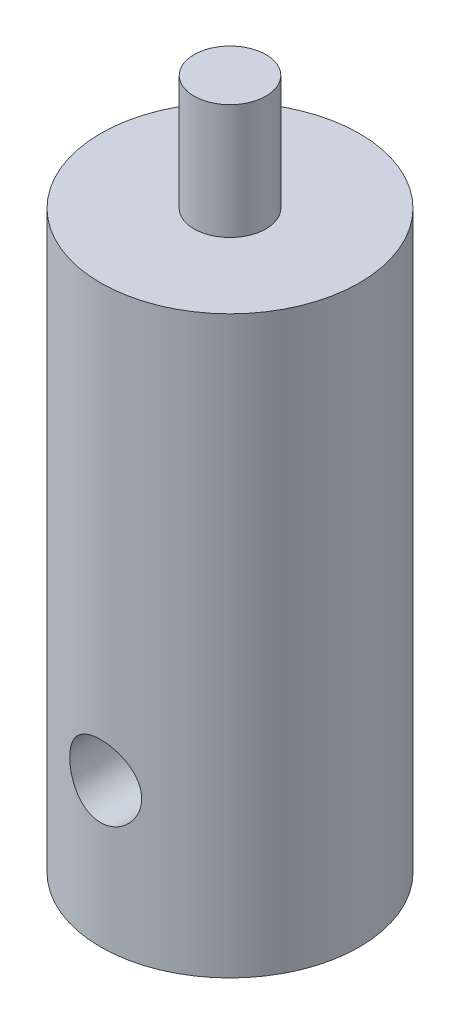
ISO-10303-21;
HEADER;
FILE_DESCRIPTION(('STEP AP214'),'2;1');
FILE_NAME('part.step','',(''),(''),'','','');
FILE_SCHEMA(('AUTOMOTIVE_DESIGN { 1 0 10303 214 1 1 1 1 }'));
ENDSEC;
DATA;
#1=APPLICATION_CONTEXT('core data for automotive mechanical design processes');
#2=APPLICATION_PROTOCOL_DEFINITION('international standard','automotive_design',2000,#1);
#3=PRODUCT_CONTEXT('',#1,'mechanical');
#4=PRODUCT('Part','Part','',(#3));
#5=PRODUCT_RELATED_PRODUCT_CATEGORY('part','',(#4));
#6=PRODUCT_DEFINITION_FORMATION('','',#4);
#7=PRODUCT_DEFINITION_CONTEXT('part definition',#1,'design');
#8=PRODUCT_DEFINITION('design','',#6,#7);
#9=PRODUCT_DEFINITION_SHAPE('','',#8);
#10=(LENGTH_UNIT() NAMED_UNIT(*) SI_UNIT(.MILLI.,.METRE.));
#11=(NAMED_UNIT(*) PLANE_ANGLE_UNIT() SI_UNIT($,.RADIAN.));
#12=(NAMED_UNIT(*) SI_UNIT($,.STERADIAN.) SOLID_ANGLE_UNIT());
#13=UNCERTAINTY_MEASURE_WITH_UNIT(LENGTH_MEASURE(1.E-05),#10,'distance_accuracy_value','');
#14=(GEOMETRIC_REPRESENTATION_CONTEXT(3) GLOBAL_UNCERTAINTY_ASSIGNED_CONTEXT((#13)) GLOBAL_UNIT_ASSIGNED_CONTEXT((#10,
#11,#12)) REPRESENTATION_CONTEXT('',''));
#15=CARTESIAN_POINT('',(0.,0.,0.));
#16=DIRECTION('',(0.,0.,1.));
#17=DIRECTION('',(1.,0.,0.));
#18=AXIS2_PLACEMENT_3D('',#15,#16,#17);
#19=CARTESIAN_POINT('',(0.,25.4,0.));
#20=DIRECTION('',(0.,-1.,0.));
#21=DIRECTION('',(0.,0.,-1.));
#22=AXIS2_PLACEMENT_3D('',#19,#20,#21);
#23=CYLINDRICAL_SURFACE('',#22,5.715);
#24=CARTESIAN_POINT('',(0.,7.9375,-5.715));
#25=CARTESIAN_POINT('',(-0.0873775886216375,7.93749822252676,-5.71499883181499));
#26=CARTESIAN_POINT('',(-0.174773747165887,7.93026186384728,-5.71297656090274));
#27=CARTESIAN_POINT('',(-0.347039534512683,7.90156442510304,-5.70510606751763));
#28=CARTESIAN_POINT('',(-0.431908081652568,7.88009734402357,-5.69925623099563));
#29=CARTESIAN_POINT('',(-0.596607836093983,7.82369692634432,-5.68437478051124));
#30=CARTESIAN_POINT('',(-0.676445675421499,7.78878176975303,-5.67534746349281));
#31=CARTESIAN_POINT('',(-0.829133082957053,7.70654604696486,-5.65505996979177));
#32=CARTESIAN_POINT('',(-0.901982029931625,7.65922437936249,-5.64379959488792));
#33=CARTESIAN_POINT('',(-1.04044341658922,7.55227161901962,-5.6199425042805));
#34=CARTESIAN_POINT('',(-1.10585645326673,7.49238780959702,-5.60732144501483));
#35=CARTESIAN_POINT('',(-1.22585249583438,7.36255032805538,-5.58231811039525));
#36=CARTESIAN_POINT('',(-1.28043397817394,7.2925952417097,-5.56993586885392));
#37=CARTESIAN_POINT('',(-1.37821426897,7.14297877963654,-5.54656046251752));
#38=CARTESIAN_POINT('',(-1.42117921183714,7.06315934527938,-5.53559786882656));
#39=CARTESIAN_POINT('',(-1.49299875556587,6.89707546459415,-5.51666284035287));
#40=CARTESIAN_POINT('',(-1.52185620617173,6.81081232397081,-5.50868980174936));
#41=CARTESIAN_POINT('',(-1.56394053947376,6.63650845815695,-5.49688871559547));
#42=CARTESIAN_POINT('',(-1.57753096868211,6.54856218653821,-5.49296445106469));
#43=CARTESIAN_POINT('',(-1.58982952388753,6.37155712536078,-5.48941814601602));
#44=CARTESIAN_POINT('',(-1.58854068914688,6.282498566712,-5.48979522689824));
#45=CARTESIAN_POINT('',(-1.57140492598854,6.10867170602045,-5.49472315867828));
#46=CARTESIAN_POINT('',(-1.55600275883773,6.02385536209935,-5.49914649057141));
#47=CARTESIAN_POINT('',(-1.51179188626399,5.85806089168913,-5.51146366649876));
#48=CARTESIAN_POINT('',(-1.48298202840585,5.77708309579526,-5.51935780885736));
#49=CARTESIAN_POINT('',(-1.41242253880776,5.62012816605167,-5.53783588617397));
#50=CARTESIAN_POINT('',(-1.3705207773298,5.5442232691512,-5.54845116622838));
#51=CARTESIAN_POINT('',(-1.27507289663136,5.40036819899916,-5.57115917368472));
#52=CARTESIAN_POINT('',(-1.22152431118906,5.33241971521782,-5.5832522137652));
#53=CARTESIAN_POINT('',(-1.10204962506124,5.20387087184574,-5.60807961601236));
#54=CARTESIAN_POINT('',(-1.03575139522199,5.14361730370259,-5.62082149948039));
#55=CARTESIAN_POINT('',(-0.893834391145315,5.03500932191218,-5.64512713759708));
#56=CARTESIAN_POINT('',(-0.818215185285896,4.98665545960985,-5.65669083764284));
#57=CARTESIAN_POINT('',(-0.659235955259406,4.9030485941498,-5.67741866435211));
#58=CARTESIAN_POINT('',(-0.57583882259964,4.86786287799759,-5.68657039779828));
#59=CARTESIAN_POINT('',(-0.403999685737538,4.81211369497946,-5.70135375476833));
#60=CARTESIAN_POINT('',(-0.315558886433836,4.79154675146116,-5.70698621521097));
#61=CARTESIAN_POINT('',(-0.139098791795691,4.7661739362907,-5.71396795333929));
#62=CARTESIAN_POINT('',(-0.0511521784405254,4.7608970759679,-5.71544518356518));
#63=CARTESIAN_POINT('',(0.12437101190844,4.76494728783138,-5.71432029972312));
#64=CARTESIAN_POINT('',(0.211947629551338,4.77427271159302,-5.71171864611273));
#65=CARTESIAN_POINT('',(0.382532780107993,4.80687803433194,-5.70281136624966));
#66=CARTESIAN_POINT('',(0.465596335968112,4.82989121022305,-5.69657658202827));
#67=CARTESIAN_POINT('',(0.626672760010776,4.88890547190038,-5.6811142304508));
#68=CARTESIAN_POINT('',(0.704685057444925,4.92490802236328,-5.67188632560348));
#69=CARTESIAN_POINT('',(0.855243578314879,5.00972566511905,-5.65116650160902));
#70=CARTESIAN_POINT('',(0.927642368680998,5.05879166588979,-5.63963148602517));
#71=CARTESIAN_POINT('',(1.06334264164549,5.16803149247548,-5.6156285595283));
#72=CARTESIAN_POINT('',(1.12664216458185,5.22820770468352,-5.6031604485359));
#73=CARTESIAN_POINT('',(1.24436127422009,5.3601638337255,-5.57821900209161));
#74=CARTESIAN_POINT('',(1.29844746514436,5.43224396347811,-5.56575732424109));
#75=CARTESIAN_POINT('',(1.3937688841484,5.58472421010726,-5.54265710496419));
#76=CARTESIAN_POINT('',(1.43500460372728,5.6651240086201,-5.53201849381697));
#77=CARTESIAN_POINT('',(1.50314794409375,5.83159510575163,-5.51389294674339));
#78=CARTESIAN_POINT('',(1.53013508405674,5.91763184994839,-5.50638856931971));
#79=CARTESIAN_POINT('',(1.56918218669103,6.09326913095929,-5.49539003653835));
#80=CARTESIAN_POINT('',(1.58124636641348,6.18286865358406,-5.49189474828006));
#81=CARTESIAN_POINT('',(1.58984772167388,6.35965933995329,-5.48941038678941));
#82=CARTESIAN_POINT('',(1.58692305188519,6.44682250131516,-5.49026512385694));
#83=CARTESIAN_POINT('',(1.56688971974818,6.61936051511925,-5.49601564056197));
#84=CARTESIAN_POINT('',(1.54978148322751,6.70473542117066,-5.50091129888046));
#85=CARTESIAN_POINT('',(1.50219059795741,6.87053138707594,-5.51409512886163));
#86=CARTESIAN_POINT('',(1.47183112594219,6.95099047016265,-5.52235200979859));
#87=CARTESIAN_POINT('',(1.39869483621833,7.1057356265843,-5.54132643386108));
#88=CARTESIAN_POINT('',(1.35591592365534,7.18002065578682,-5.55204439204603));
#89=CARTESIAN_POINT('',(1.25756284176664,7.32285511908797,-5.57515789697432));
#90=CARTESIAN_POINT('',(1.20162584711976,7.39114787538706,-5.58759587307472));
#91=CARTESIAN_POINT('',(1.07922253986234,7.51755211250789,-5.6125215652489));
#92=CARTESIAN_POINT('',(1.0127536204478,7.57566106517155,-5.62500929288894));
#93=CARTESIAN_POINT('',(0.869264495031011,7.68141483345416,-5.64898336268566));
#94=CARTESIAN_POINT('',(0.792030748843862,7.72877756160457,-5.66043878314845));
#95=CARTESIAN_POINT('',(0.630379718019909,7.80977373689764,-5.68070968123768));
#96=CARTESIAN_POINT('',(0.545966688324441,7.8434152485979,-5.68952670874876));
#97=CARTESIAN_POINT('',(0.384994764383709,7.89205950253307,-5.70250415036577));
#98=CARTESIAN_POINT('',(0.3090727907543,7.90905808024295,-5.70715451990556));
#99=CARTESIAN_POINT('',(0.155438634630629,7.93177845419463,-5.71340278419882));
#100=CARTESIAN_POINT('',(0.077726664484657,7.93750158114991,-5.71500103915804));
#101=CARTESIAN_POINT('',(0.,7.9375,-5.715));
#102=B_SPLINE_CURVE_WITH_KNOTS('',3,(#24,#25,#26,#27,#28,#29,#30,#31,#32,#33,#34,#35,#36,#37,
#38,#39,#40,#41,#42,#43,#44,#45,#46,#47,#48,#49,#50,#51,#52,#53,#54,#55,#56,#57,#58,#59,#60,#61,
#62,#63,#64,#65,#66,#67,#68,#69,#70,#71,#72,#73,#74,#75,#76,#77,#78,#79,#80,#81,#82,#83,#84,#85,
#86,#87,#88,#89,#90,#91,#92,#93,#94,#95,#96,#97,#98,#99,#100,#101),.UNSPECIFIED.,.T.,.F.,(4,2,2,
2,2,2,2,2,2,2,2,2,2,2,2,2,2,2,2,2,2,2,2,2,2,2,2,2,2,2,2,2,2,2,2,2,2,2,4),(0.,0.261847575236353,
0.523805640407021,0.785410809087426,1.04703921000417,1.31454682893085,1.58209204845874,
1.85467866711063,2.12721019989398,2.39310458565513,2.65894466036424,2.91668495903396,
3.17444741542485,3.43532409257193,3.69625606438258,3.96645757180026,4.23667159601406,
4.50824810363217,4.77976000300069,5.04281453452862,5.30583937246127,5.56389943201969,
5.8219885994262,6.08544565088528,6.34895935698785,6.62058609468181,6.89220244204175,
7.16228647370105,7.4322941653749,7.69267701045832,7.95305203845297,8.21105664821713,
8.46910480232684,8.7353382986325,9.00163779482148,9.27427775048171,9.54675723202644,
9.77971102892349,10.0126373312806),.UNSPECIFIED.);
#103=CARTESIAN_POINT('',(0.,7.9375,-5.715));
#104=VERTEX_POINT('',#103);
#105=EDGE_CURVE('E63',#104,#104,#102,.T.);
#106=ORIENTED_EDGE('',*,*,#105,.T.);
#107=EDGE_LOOP('',(#106));
#108=FACE_BOUND('',#107,.T.);
#109=CARTESIAN_POINT('',(1.5875,6.35,5.49008822788851));
#110=CARTESIAN_POINT('',(1.5874981902277,6.26269578466203,5.49008958808701));
#111=CARTESIAN_POINT('',(1.58027355665008,6.17537294255391,5.49219349194744));
#112=CARTESIAN_POINT('',(1.55162690510411,6.00325914190088,5.50035396036363));
#113=CARTESIAN_POINT('',(1.53019854592187,5.9184693318986,5.50641229034351));
#114=CARTESIAN_POINT('',(1.47391125512293,5.7539367225078,5.52174368993515));
#115=CARTESIAN_POINT('',(1.43907230437625,5.67418661912143,5.53101197488213));
#116=CARTESIAN_POINT('',(1.35701644660104,5.5216482644948,5.5517127666448));
#117=CARTESIAN_POINT('',(1.30979828246154,5.44886072132875,5.56314549322707));
#118=CARTESIAN_POINT('',(1.20295372761295,5.3103387217049,5.58723471225787));
#119=CARTESIAN_POINT('',(1.14305129448045,5.24482116030103,5.59991434967821));
#120=CARTESIAN_POINT('',(1.01313162219618,5.12462091721002,5.62486962282239));
#121=CARTESIAN_POINT('',(0.943113259157836,5.06993944102223,5.63714521347005));
#122=CARTESIAN_POINT('',(0.793432772355308,4.97204716716263,5.66016903741153));
#123=CARTESIAN_POINT('',(0.713623368032879,4.9290537741788,5.67088679401328));
#124=CARTESIAN_POINT('',(0.547560729901386,4.85717896116259,5.68932071628732));
#125=CARTESIAN_POINT('',(0.461308682340718,4.82829495059553,5.69703743290853));
#126=CARTESIAN_POINT('',(0.287074838730724,4.78616584962491,5.70843612146163));
#127=CARTESIAN_POINT('',(0.199188689167557,4.77255138816408,5.71221322662196));
#128=CARTESIAN_POINT('',(0.0223040301179934,4.76018386502342,5.71564050789019));
#129=CARTESIAN_POINT('',(-0.0666942750584624,4.76142811266148,5.71529143118582));
#130=CARTESIAN_POINT('',(-0.240699446941865,4.77848647576372,5.71057459847628));
#131=CARTESIAN_POINT('',(-0.325748910378636,4.79390123512036,5.70631699777793));
#132=CARTESIAN_POINT('',(-0.492002751909775,4.83821558277767,5.69439272662884));
#133=CARTESIAN_POINT('',(-0.573206901593866,4.86711597101598,5.68672585394889));
#134=CARTESIAN_POINT('',(-0.730461830792671,4.93787562117029,5.66868469134966));
#135=CARTESIAN_POINT('',(-0.806449381883302,4.97986806254791,5.6582827574806));
#136=CARTESIAN_POINT('',(-0.950432803911044,5.07551665604555,5.635886755573));
#137=CARTESIAN_POINT('',(-1.01842699974348,5.12917524625939,5.62389235493113));
#138=CARTESIAN_POINT('',(-1.14687779284276,5.24873769768856,5.59913576148703));
#139=CARTESIAN_POINT('',(-1.20700879412453,5.31498924658508,5.58636129966102));
#140=CARTESIAN_POINT('',(-1.31539048634046,5.45676624870255,5.56184043301439));
#141=CARTESIAN_POINT('',(-1.36364031962496,5.53229237082503,5.5500941024495));
#142=CARTESIAN_POINT('',(-1.44716651207443,5.69122859809694,5.52890698854404));
#143=CARTESIAN_POINT('',(-1.48234718542031,5.77469144100979,5.51948337343365));
#144=CARTESIAN_POINT('',(-1.53806714003665,5.94667568330611,5.50421824281675));
#145=CARTESIAN_POINT('',(-1.55861041122048,6.03519569707664,5.49837575121602));
#146=CARTESIAN_POINT('',(-1.58389609233674,6.21171891638252,5.49114439190616));
#147=CARTESIAN_POINT('',(-1.58912718332319,6.29964655409458,5.48961783914087));
#148=CARTESIAN_POINT('',(-1.58499233459042,6.47512166393204,5.4908131784206));
#149=CARTESIAN_POINT('',(-1.57562810048152,6.56266917927969,5.49353457405023));
#150=CARTESIAN_POINT('',(-1.54300073307033,6.7329670691545,5.50278547593519));
#151=CARTESIAN_POINT('',(-1.52003798013852,6.81577990971945,5.50923261133757));
#152=CARTESIAN_POINT('',(-1.46120649584588,6.97637684420757,5.52512651740428));
#153=CARTESIAN_POINT('',(-1.4253359755726,7.05416023932655,5.53457370383014));
#154=CARTESIAN_POINT('',(-1.34073627722052,7.20451655903459,5.55568080133372));
#155=CARTESIAN_POINT('',(-1.291723777132,7.27692332460937,5.56738764507707));
#156=CARTESIAN_POINT('',(-1.18257778373147,7.41266376498798,5.59158774625878));
#157=CARTESIAN_POINT('',(-1.12244201572022,7.4759955792619,5.60408116420558));
#158=CARTESIAN_POINT('',(-0.990484072156665,7.59385163381099,5.62892587661335));
#159=CARTESIAN_POINT('',(-0.918351985180729,7.64803322439304,5.64126012522886));
#160=CARTESIAN_POINT('',(-0.765735776672124,7.74352272163418,5.66399300827946));
#161=CARTESIAN_POINT('',(-0.685252097979115,7.7848313104143,5.67439174526266));
#162=CARTESIAN_POINT('',(-0.518781280973118,7.85301299080786,5.69201508145047));
#163=CARTESIAN_POINT('',(-0.432841464167173,7.87999514045268,5.69926358226907));
#164=CARTESIAN_POINT('',(-0.257413958688554,7.91906479013488,5.709875187027));
#165=CARTESIAN_POINT('',(-0.167927134043635,7.9311558947962,5.71323923125105));
#166=CARTESIAN_POINT('',(0.00886469674710871,7.93985859935078,5.71565431802932));
#167=CARTESIAN_POINT('',(0.0961434860144429,7.93697085900255,5.71484486306348));
#168=CARTESIAN_POINT('',(0.268922893527082,7.91697136281848,5.70932366417504));
#169=CARTESIAN_POINT('',(0.354423588759804,7.89986022414317,5.70461208956743));
#170=CARTESIAN_POINT('',(0.520563464503072,7.85219205299598,5.69184779898009));
#171=CARTESIAN_POINT('',(0.601236196738761,7.82174420031203,5.68382224254877));
#172=CARTESIAN_POINT('',(0.756373397005552,7.74836401922357,5.6652656588866));
#173=CARTESIAN_POINT('',(0.830836937963368,7.7054298308059,5.654734258418));
#174=CARTESIAN_POINT('',(0.973741462298891,7.60687331637419,5.63191277316687));
#175=CARTESIAN_POINT('',(1.04195071421183,7.55092464534134,5.61958116454264));
#176=CARTESIAN_POINT('',(1.16818132868967,7.42853611416834,5.59470509708707));
#177=CARTESIAN_POINT('',(1.22619992799942,7.36209341775877,5.58216058153284));
#178=CARTESIAN_POINT('',(1.33181243612629,7.21865173140569,5.5579235650459));
#179=CARTESIAN_POINT('',(1.37911710939714,7.14143454257856,5.54625935835308));
#180=CARTESIAN_POINT('',(1.46000884434428,6.97982856807194,5.52551844997696));
#181=CARTESIAN_POINT('',(1.49360414280628,6.89544412551158,5.51644019561011));
#182=CARTESIAN_POINT('',(1.54215779249416,6.73458131762955,5.50304554554766));
#183=CARTESIAN_POINT('',(1.55911907762565,6.65874372747527,5.49822789527777));
#184=CARTESIAN_POINT('',(1.58179021012458,6.50527550337397,5.49174884928359));
#185=CARTESIAN_POINT('',(1.58750160954409,6.4276451182591,5.49008701817861));
#186=CARTESIAN_POINT('',(1.5875,6.35,5.49008822788851));
#187=B_SPLINE_CURVE_WITH_KNOTS('',3,(#109,#110,#111,#112,#113,#114,#115,#116,#117,#118,#119,
#120,#121,#122,#123,#124,#125,#126,#127,#128,#129,#130,#131,#132,#133,#134,#135,#136,#137,#138,
#139,#140,#141,#142,#143,#144,#145,#146,#147,#148,#149,#150,#151,#152,#153,#154,#155,#156,#157,
#158,#159,#160,#161,#162,#163,#164,#165,#166,#167,#168,#169,#170,#171,#172,#173,#174,#175,#176,
#177,#178,#179,#180,#181,#182,#183,#184,#185,#186),.UNSPECIFIED.,.T.,.F.,(4,2,2,2,2,2,2,2,2,2,2,
2,2,2,2,2,2,2,2,2,2,2,2,2,2,2,2,2,2,2,2,2,2,2,2,2,2,2,4),(0.,0.261626852722489,
0.523370586768617,0.784725840551893,1.04610764528761,1.31390323807619,1.58172860604627,
1.8542393493665,2.12670003988531,2.3924173082771,2.65808646011643,2.91649065873982,
3.17491018727675,3.43604934647678,3.69724313337275,3.96711725975192,4.23701086145917,
4.5088432645388,4.7806015422315,5.04358679980531,5.30654132721459,5.56389335335162,
5.82128106014961,6.08473933950059,6.34825155554105,6.62011316474682,6.89196036596343,
7.16170737157074,7.43138906760762,7.69211609103834,7.95283180198063,8.21145195314675,
8.47011064912705,8.73613117800775,9.00222372892837,9.27481558455994,9.54724342117075,
9.77995670978005,10.0126378906458),.UNSPECIFIED.);
#188=CARTESIAN_POINT('',(1.5875,6.35,5.49008822788851));
#189=VERTEX_POINT('',#188);
#190=EDGE_CURVE('E60',#189,#189,#187,.T.);
#191=ORIENTED_EDGE('',*,*,#190,.T.);
#192=EDGE_LOOP('',(#191));
#193=FACE_BOUND('',#192,.T.);
#194=CARTESIAN_POINT('',(0.,25.4,0.));
#195=DIRECTION('',(0.,1.,0.));
#196=DIRECTION('',(0.,0.,1.));
#197=AXIS2_PLACEMENT_3D('',#194,#195,#196);
#198=CIRCLE('',#197,5.715);
#199=CARTESIAN_POINT('',(0.,25.4,5.715));
#200=VERTEX_POINT('',#199);
#201=EDGE_CURVE('E44',#200,#200,#198,.T.);
#202=ORIENTED_EDGE('',*,*,#201,.F.);
#203=EDGE_LOOP('',(#202));
#204=FACE_BOUND('',#203,.T.);
#205=CARTESIAN_POINT('',(0.,0.,0.));
#206=DIRECTION('',(0.,1.,0.));
#207=DIRECTION('',(0.,0.,1.));
#208=AXIS2_PLACEMENT_3D('',#205,#206,#207);
#209=CIRCLE('',#208,5.715);
#210=CARTESIAN_POINT('',(0.,0.,5.715));
#211=VERTEX_POINT('',#210);
#212=EDGE_CURVE('E39',#211,#211,#209,.T.);
#213=ORIENTED_EDGE('',*,*,#212,.T.);
#214=EDGE_LOOP('',(#213));
#215=FACE_BOUND('',#214,.T.);
#216=ADVANCED_FACE('F35',(#108,#193,#204,#215),#23,.T.);
#217=CARTESIAN_POINT('',(0.,25.4,0.));
#218=DIRECTION('',(0.,1.,0.));
#219=DIRECTION('',(0.,0.,1.));
#220=AXIS2_PLACEMENT_3D('',#217,#218,#219);
#221=PLANE('',#220);
#222=CARTESIAN_POINT('',(0.,25.4,0.));
#223=DIRECTION('',(0.,1.,0.));
#224=DIRECTION('',(0.,0.,1.));
#225=AXIS2_PLACEMENT_3D('',#222,#223,#224);
#226=CIRCLE('',#225,1.5875);
#227=CARTESIAN_POINT('',(0.,25.4,1.5875));
#228=VERTEX_POINT('',#227);
#229=EDGE_CURVE('E11',#228,#228,#226,.T.);
#230=ORIENTED_EDGE('',*,*,#229,.F.);
#231=EDGE_LOOP('',(#230));
#232=FACE_BOUND('',#231,.T.);
#233=ORIENTED_EDGE('',*,*,#201,.T.);
#234=EDGE_LOOP('',(#233));
#235=FACE_BOUND('',#234,.T.);
#236=ADVANCED_FACE('F89',(#232,#235),#221,.T.);
#237=CARTESIAN_POINT('',(0.,0.,0.));
#238=DIRECTION('',(0.,1.,0.));
#239=DIRECTION('',(0.,0.,1.));
#240=AXIS2_PLACEMENT_3D('',#237,#238,#239);
#241=PLANE('',#240);
#242=CARTESIAN_POINT('',(0.,0.,0.));
#243=DIRECTION('',(0.,-1.,0.));
#244=DIRECTION('',(0.,0.,-1.));
#245=AXIS2_PLACEMENT_3D('',#242,#243,#244);
#246=CIRCLE('',#245,1.5875);
#247=CARTESIAN_POINT('',(0.,0.,-1.5875));
#248=VERTEX_POINT('',#247);
#249=EDGE_CURVE('E114',#248,#248,#246,.T.);
#250=ORIENTED_EDGE('',*,*,#249,.F.);
#251=EDGE_LOOP('',(#250));
#252=FACE_BOUND('',#251,.T.);
#253=ORIENTED_EDGE('',*,*,#212,.F.);
#254=EDGE_LOOP('',(#253));
#255=FACE_BOUND('',#254,.T.);
#256=ADVANCED_FACE('F87',(#252,#255),#241,.F.);
#257=CARTESIAN_POINT('',(0.,30.48,0.));
#258=DIRECTION('',(0.,-1.,0.));
#259=DIRECTION('',(0.,0.,-1.));
#260=AXIS2_PLACEMENT_3D('',#257,#258,#259);
#261=CYLINDRICAL_SURFACE('',#260,1.5875);
#262=CARTESIAN_POINT('',(0.,30.48,0.));
#263=DIRECTION('',(0.,1.,0.));
#264=DIRECTION('',(0.,0.,1.));
#265=AXIS2_PLACEMENT_3D('',#262,#263,#264);
#266=CIRCLE('',#265,1.5875);
#267=CARTESIAN_POINT('',(0.,30.48,1.5875));
#268=VERTEX_POINT('',#267);
#269=EDGE_CURVE('E112',#268,#268,#266,.T.);
#270=ORIENTED_EDGE('',*,*,#269,.F.);
#271=EDGE_LOOP('',(#270));
#272=FACE_BOUND('',#271,.T.);
#273=ORIENTED_EDGE('',*,*,#229,.T.);
#274=EDGE_LOOP('',(#273));
#275=FACE_BOUND('',#274,.T.);
#276=ADVANCED_FACE('F83',(#272,#275),#261,.T.);
#277=CARTESIAN_POINT('',(0.,30.48,0.));
#278=DIRECTION('',(0.,1.,0.));
#279=DIRECTION('',(0.,0.,1.));
#280=AXIS2_PLACEMENT_3D('',#277,#278,#279);
#281=PLANE('',#280);
#282=ORIENTED_EDGE('',*,*,#269,.T.);
#283=EDGE_LOOP('',(#282));
#284=FACE_BOUND('',#283,.T.);
#285=ADVANCED_FACE('F80',(#284),#281,.T.);
#286=CARTESIAN_POINT('',(0.,6.35,0.));
#287=DIRECTION('',(0.,-1.,0.));
#288=DIRECTION('',(0.,0.,-1.));
#289=AXIS2_PLACEMENT_3D('',#286,#287,#288);
#290=CYLINDRICAL_SURFACE('',#289,1.5875);
#291=CARTESIAN_POINT('',(0.,6.35,0.));
#292=DIRECTION('',(0.,-0.707106781186547,-0.707106781186547));
#293=DIRECTION('',(0.,-0.707106781186547,0.707106781186547));
#294=AXIS2_PLACEMENT_3D('',#291,#292,#293);
#295=ELLIPSE('',#294,2.24506403026729,1.5875);
#296=CARTESIAN_POINT('',(-1.5875,6.35,0.));
#297=VERTEX_POINT('',#296);
#298=CARTESIAN_POINT('',(1.5875,6.35,0.));
#299=VERTEX_POINT('',#298);
#300=EDGE_CURVE('E53',#297,#299,#295,.F.);
#301=ORIENTED_EDGE('',*,*,#300,.T.);
#302=CARTESIAN_POINT('',(0.,6.35,0.));
#303=DIRECTION('',(0.,-0.707106781186547,0.707106781186547));
#304=DIRECTION('',(0.,-0.707106781186547,-0.707106781186547));
#305=AXIS2_PLACEMENT_3D('',#302,#303,#304);
#306=ELLIPSE('',#305,2.24506403026729,1.5875);
#307=EDGE_CURVE('E51',#299,#297,#306,.F.);
#308=ORIENTED_EDGE('',*,*,#307,.T.);
#309=EDGE_LOOP('',(#301,#308));
#310=FACE_BOUND('',#309,.T.);
#311=ORIENTED_EDGE('',*,*,#249,.T.);
#312=EDGE_LOOP('',(#311));
#313=FACE_BOUND('',#312,.T.);
#314=ADVANCED_FACE('F58',(#310,#313),#290,.F.);
#315=CARTESIAN_POINT('',(0.,6.35,-5.715));
#316=DIRECTION('',(0.,0.,1.));
#317=DIRECTION('',(1.,0.,0.));
#318=AXIS2_PLACEMENT_3D('',#315,#316,#317);
#319=CYLINDRICAL_SURFACE('',#318,1.5875);
#320=ORIENTED_EDGE('',*,*,#300,.F.);
#321=ORIENTED_EDGE('',*,*,#307,.F.);
#322=EDGE_LOOP('',(#320,#321));
#323=FACE_BOUND('',#322,.T.);
#324=ORIENTED_EDGE('',*,*,#190,.F.);
#325=EDGE_LOOP('',(#324));
#326=FACE_BOUND('',#325,.T.);
#327=ORIENTED_EDGE('',*,*,#105,.F.);
#328=EDGE_LOOP('',(#327));
#329=FACE_BOUND('',#328,.T.);
#330=ADVANCED_FACE('F54',(#323,#326,#329),#319,.F.);
#331=CLOSED_SHELL('',(#216,#236,#256,#276,#285,#314,#330));
#332=MANIFOLD_SOLID_BREP('B2',#331);
#333=ADVANCED_BREP_SHAPE_REPRESENTATION('',(#18,#332),#14);
#334=SHAPE_DEFINITION_REPRESENTATION(#9,#333);
ENDSEC;
END-ISO-10303-21;
